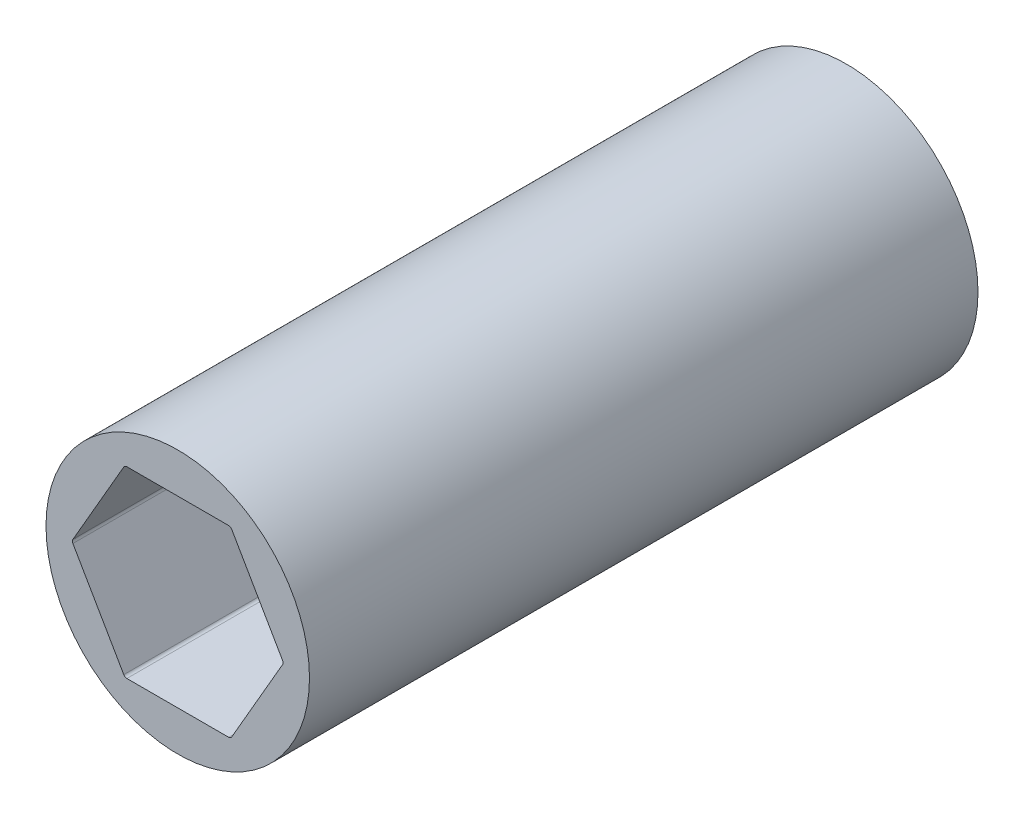
ISO-10303-21;
HEADER;
FILE_DESCRIPTION(('STEP AP214'),'2;1');
FILE_NAME('part.step','',(''),(''),'','','');
FILE_SCHEMA(('AUTOMOTIVE_DESIGN { 1 0 10303 214 1 1 1 1 }'));
ENDSEC;
DATA;
#1=APPLICATION_CONTEXT('core data for automotive mechanical design processes');
#2=APPLICATION_PROTOCOL_DEFINITION('international standard','automotive_design',2000,#1);
#3=PRODUCT_CONTEXT('',#1,'mechanical');
#4=PRODUCT('Part','Part','',(#3));
#5=PRODUCT_RELATED_PRODUCT_CATEGORY('part','',(#4));
#6=PRODUCT_DEFINITION_FORMATION('','',#4);
#7=PRODUCT_DEFINITION_CONTEXT('part definition',#1,'design');
#8=PRODUCT_DEFINITION('design','',#6,#7);
#9=PRODUCT_DEFINITION_SHAPE('','',#8);
#10=(LENGTH_UNIT() NAMED_UNIT(*) SI_UNIT(.MILLI.,.METRE.));
#11=(NAMED_UNIT(*) PLANE_ANGLE_UNIT() SI_UNIT($,.RADIAN.));
#12=(NAMED_UNIT(*) SI_UNIT($,.STERADIAN.) SOLID_ANGLE_UNIT());
#13=UNCERTAINTY_MEASURE_WITH_UNIT(LENGTH_MEASURE(1.E-05),#10,'distance_accuracy_value','');
#14=(GEOMETRIC_REPRESENTATION_CONTEXT(3) GLOBAL_UNCERTAINTY_ASSIGNED_CONTEXT((#13)) GLOBAL_UNIT_ASSIGNED_CONTEXT((#10,
#11,#12)) REPRESENTATION_CONTEXT('',''));
#15=CARTESIAN_POINT('',(0.,0.,0.));
#16=DIRECTION('',(0.,0.,1.));
#17=DIRECTION('',(1.,0.,0.));
#18=AXIS2_PLACEMENT_3D('',#15,#16,#17);
#19=CARTESIAN_POINT('',(7.25902493452117,0.,30.48));
#20=DIRECTION('',(0.,0.,1.));
#21=DIRECTION('',(1.,0.,0.));
#22=AXIS2_PLACEMENT_3D('',#19,#20,#21);
#23=CYLINDRICAL_SURFACE('',#22,0.254);
#24=CARTESIAN_POINT('',(7.25902493452117,0.,0.));
#25=DIRECTION('',(0.,0.,1.));
#26=DIRECTION('',(1.,0.,0.));
#27=AXIS2_PLACEMENT_3D('',#24,#25,#26);
#28=CIRCLE('',#27,0.254);
#29=CARTESIAN_POINT('',(7.51302493452117,0.,0.));
#30=VERTEX_POINT('',#29);
#31=CARTESIAN_POINT('',(7.47899538708242,0.127,0.));
#32=VERTEX_POINT('',#31);
#33=EDGE_CURVE('E67',#30,#32,#28,.T.);
#34=ORIENTED_EDGE('',*,*,#33,.F.);
#35=DIRECTION('',(0.,0.,1.));
#36=VECTOR('',#35,1.);
#37=CARTESIAN_POINT('',(7.51302493452117,0.,30.48));
#38=LINE('',#37,#36);
#39=CARTESIAN_POINT('',(7.51302493452117,0.,30.48));
#40=VERTEX_POINT('',#39);
#41=EDGE_CURVE('E11',#30,#40,#38,.T.);
#42=ORIENTED_EDGE('',*,*,#41,.T.);
#43=ORIENTED_EDGE('',*,*,#41,.F.);
#44=CARTESIAN_POINT('',(7.25902493452117,0.,0.));
#45=DIRECTION('',(0.,0.,1.));
#46=DIRECTION('',(1.,0.,0.));
#47=AXIS2_PLACEMENT_3D('',#44,#45,#46);
#48=CIRCLE('',#47,0.254);
#49=CARTESIAN_POINT('',(7.47899538708242,-0.127000000000001,0.));
#50=VERTEX_POINT('',#49);
#51=EDGE_CURVE('E150',#50,#30,#48,.T.);
#52=ORIENTED_EDGE('',*,*,#51,.F.);
#53=DIRECTION('',(0.,0.,-1.));
#54=VECTOR('',#53,1.);
#55=CARTESIAN_POINT('',(7.47899538708242,-0.127,0.));
#56=LINE('',#55,#54);
#57=CARTESIAN_POINT('',(7.47899538708242,-0.127000000000002,47.6885));
#58=VERTEX_POINT('',#57);
#59=EDGE_CURVE('E128',#58,#50,#56,.T.);
#60=ORIENTED_EDGE('',*,*,#59,.F.);
#61=CARTESIAN_POINT('',(7.25902493452117,0.,47.6885));
#62=DIRECTION('',(0.,0.,1.));
#63=DIRECTION('',(1.,0.,0.));
#64=AXIS2_PLACEMENT_3D('',#61,#62,#63);
#65=CIRCLE('',#64,0.254000000000002);
#66=CARTESIAN_POINT('',(7.47899538708242,0.127,47.6885));
#67=VERTEX_POINT('',#66);
#68=EDGE_CURVE('E659',#58,#67,#65,.T.);
#69=ORIENTED_EDGE('',*,*,#68,.T.);
#70=DIRECTION('',(0.,0.,1.));
#71=VECTOR('',#70,1.);
#72=CARTESIAN_POINT('',(7.47899538708242,0.127,30.48));
#73=LINE('',#72,#71);
#74=EDGE_CURVE('E160',#32,#67,#73,.T.);
#75=ORIENTED_EDGE('',*,*,#74,.F.);
#76=EDGE_LOOP('',(#34,#42,#43,#52,#60,#69,#75));
#77=FACE_BOUND('',#76,.T.);
#78=ADVANCED_FACE('F43',(#77),#23,.F.);
#79=CARTESIAN_POINT('',(0.,0.,30.48));
#80=DIRECTION('',(0.,0.,-1.));
#81=DIRECTION('',(-1.,0.,0.));
#82=AXIS2_PLACEMENT_3D('',#79,#80,#81);
#83=CYLINDRICAL_SURFACE('',#82,9.398);
#84=DIRECTION('',(0.,0.,-1.));
#85=VECTOR('',#84,1.);
#86=CARTESIAN_POINT('',(-9.398,0.,30.48));
#87=LINE('',#86,#85);
#88=CARTESIAN_POINT('',(-9.398,0.,30.48));
#89=VERTEX_POINT('',#88);
#90=CARTESIAN_POINT('',(-9.398,0.,0.));
#91=VERTEX_POINT('',#90);
#92=EDGE_CURVE('E104',#89,#91,#87,.T.);
#93=ORIENTED_EDGE('',*,*,#92,.F.);
#94=ORIENTED_EDGE('',*,*,#92,.T.);
#95=CARTESIAN_POINT('',(0.,0.,0.));
#96=DIRECTION('',(0.,0.,1.));
#97=DIRECTION('',(1.,0.,0.));
#98=AXIS2_PLACEMENT_3D('',#95,#96,#97);
#99=CIRCLE('',#98,9.398);
#100=CARTESIAN_POINT('',(9.398,0.,0.));
#101=VERTEX_POINT('',#100);
#102=EDGE_CURVE('E109',#91,#101,#99,.T.);
#103=ORIENTED_EDGE('',*,*,#102,.T.);
#104=DIRECTION('',(0.,0.,-1.));
#105=VECTOR('',#104,1.);
#106=CARTESIAN_POINT('',(9.398,0.,30.48));
#107=LINE('',#106,#105);
#108=CARTESIAN_POINT('',(9.398,0.,30.48));
#109=VERTEX_POINT('',#108);
#110=EDGE_CURVE('E54',#109,#101,#107,.T.);
#111=ORIENTED_EDGE('',*,*,#110,.F.);
#112=ORIENTED_EDGE('',*,*,#110,.T.);
#113=CARTESIAN_POINT('',(0.,0.,0.));
#114=DIRECTION('',(0.,0.,1.));
#115=DIRECTION('',(1.,0.,0.));
#116=AXIS2_PLACEMENT_3D('',#113,#114,#115);
#117=CIRCLE('',#116,9.398);
#118=EDGE_CURVE('E115',#101,#91,#117,.T.);
#119=ORIENTED_EDGE('',*,*,#118,.T.);
#120=EDGE_LOOP('',(#93,#94,#103,#111,#112,#119));
#121=FACE_BOUND('',#120,.T.);
#122=CARTESIAN_POINT('',(0.,0.,47.6885));
#123=DIRECTION('',(0.,0.,1.));
#124=DIRECTION('',(1.,0.,0.));
#125=AXIS2_PLACEMENT_3D('',#122,#123,#124);
#126=CIRCLE('',#125,9.398);
#127=CARTESIAN_POINT('',(9.398,0.,47.6885));
#128=VERTEX_POINT('',#127);
#129=EDGE_CURVE('E614',#128,#128,#126,.T.);
#130=ORIENTED_EDGE('',*,*,#129,.F.);
#131=EDGE_LOOP('',(#130));
#132=FACE_BOUND('',#131,.T.);
#133=ADVANCED_FACE('F106',(#121,#132),#83,.T.);
#134=CARTESIAN_POINT('',(0.,0.,0.));
#135=DIRECTION('',(0.,0.,1.));
#136=DIRECTION('',(1.,0.,0.));
#137=AXIS2_PLACEMENT_3D('',#134,#135,#136);
#138=PLANE('',#137);
#139=ORIENTED_EDGE('',*,*,#102,.F.);
#140=ORIENTED_EDGE('',*,*,#118,.F.);
#141=EDGE_LOOP('',(#139,#140));
#142=FACE_BOUND('',#141,.T.);
#143=DIRECTION('',(1.,0.,0.));
#144=VECTOR('',#143,1.);
#145=CARTESIAN_POINT('',(-3.77615943563474,-6.5405,0.));
#146=LINE('',#145,#144);
#147=CARTESIAN_POINT('',(-3.62951246726058,-6.5405,0.));
#148=VERTEX_POINT('',#147);
#149=CARTESIAN_POINT('',(3.62951246726058,-6.5405,0.));
#150=VERTEX_POINT('',#149);
#151=EDGE_CURVE('E118',#148,#150,#146,.T.);
#152=ORIENTED_EDGE('',*,*,#151,.T.);
#153=CARTESIAN_POINT('',(3.62951246726059,-6.2865,0.));
#154=DIRECTION('',(0.,0.,1.));
#155=DIRECTION('',(1.,0.,0.));
#156=AXIS2_PLACEMENT_3D('',#153,#154,#155);
#157=CIRCLE('',#156,0.254);
#158=CARTESIAN_POINT('',(3.84948291982184,-6.4135,0.));
#159=VERTEX_POINT('',#158);
#160=EDGE_CURVE('E149',#150,#159,#157,.T.);
#161=ORIENTED_EDGE('',*,*,#160,.T.);
#162=DIRECTION('',(0.5,0.866025403784439,0.));
#163=VECTOR('',#162,1.);
#164=CARTESIAN_POINT('',(3.77615943563475,-6.5405,0.));
#165=LINE('',#164,#163);
#166=EDGE_CURVE('E145',#159,#50,#165,.T.);
#167=ORIENTED_EDGE('',*,*,#166,.T.);
#168=ORIENTED_EDGE('',*,*,#51,.T.);
#169=ORIENTED_EDGE('',*,*,#33,.T.);
#170=DIRECTION('',(-0.5,0.866025403784438,0.));
#171=VECTOR('',#170,1.);
#172=CARTESIAN_POINT('',(7.5523188712695,0.,0.));
#173=LINE('',#172,#171);
#174=CARTESIAN_POINT('',(3.84948291982183,6.4135,0.));
#175=VERTEX_POINT('',#174);
#176=EDGE_CURVE('E140',#32,#175,#173,.T.);
#177=ORIENTED_EDGE('',*,*,#176,.T.);
#178=CARTESIAN_POINT('',(3.62951246726058,6.2865,0.));
#179=DIRECTION('',(0.,0.,1.));
#180=DIRECTION('',(1.,0.,0.));
#181=AXIS2_PLACEMENT_3D('',#178,#179,#180);
#182=CIRCLE('',#181,0.254);
#183=CARTESIAN_POINT('',(3.62951246726058,6.5405,0.));
#184=VERTEX_POINT('',#183);
#185=EDGE_CURVE('E144',#175,#184,#182,.T.);
#186=ORIENTED_EDGE('',*,*,#185,.T.);
#187=DIRECTION('',(-1.,0.,0.));
#188=VECTOR('',#187,1.);
#189=CARTESIAN_POINT('',(3.77615943563475,6.5405,0.));
#190=LINE('',#189,#188);
#191=CARTESIAN_POINT('',(-3.62951246726058,6.5405,0.));
#192=VERTEX_POINT('',#191);
#193=EDGE_CURVE('E138',#184,#192,#190,.T.);
#194=ORIENTED_EDGE('',*,*,#193,.T.);
#195=CARTESIAN_POINT('',(-3.62951246726058,6.2865,0.));
#196=DIRECTION('',(0.,0.,1.));
#197=DIRECTION('',(1.,0.,0.));
#198=AXIS2_PLACEMENT_3D('',#195,#196,#197);
#199=CIRCLE('',#198,0.254);
#200=CARTESIAN_POINT('',(-3.84948291982183,6.4135,0.));
#201=VERTEX_POINT('',#200);
#202=EDGE_CURVE('E134',#192,#201,#199,.T.);
#203=ORIENTED_EDGE('',*,*,#202,.T.);
#204=DIRECTION('',(-0.5,-0.866025403784439,0.));
#205=VECTOR('',#204,1.);
#206=CARTESIAN_POINT('',(-3.77615943563474,6.5405,0.));
#207=LINE('',#206,#205);
#208=CARTESIAN_POINT('',(-7.47899538708241,0.127000000000003,0.));
#209=VERTEX_POINT('',#208);
#210=EDGE_CURVE('E139',#201,#209,#207,.T.);
#211=ORIENTED_EDGE('',*,*,#210,.T.);
#212=CARTESIAN_POINT('',(-7.25902493452117,0.,0.));
#213=DIRECTION('',(0.,0.,1.));
#214=DIRECTION('',(1.,0.,0.));
#215=AXIS2_PLACEMENT_3D('',#212,#213,#214);
#216=CIRCLE('',#215,0.254);
#217=CARTESIAN_POINT('',(-7.47899538708241,-0.126999999999999,0.));
#218=VERTEX_POINT('',#217);
#219=EDGE_CURVE('E151',#209,#218,#216,.T.);
#220=ORIENTED_EDGE('',*,*,#219,.T.);
#221=DIRECTION('',(0.5,-0.866025403784439,0.));
#222=VECTOR('',#221,1.);
#223=CARTESIAN_POINT('',(-7.5523188712695,0.,0.));
#224=LINE('',#223,#222);
#225=CARTESIAN_POINT('',(-3.84948291982183,-6.4135,0.));
#226=VERTEX_POINT('',#225);
#227=EDGE_CURVE('E155',#218,#226,#224,.T.);
#228=ORIENTED_EDGE('',*,*,#227,.T.);
#229=CARTESIAN_POINT('',(-3.62951246726058,-6.2865,0.));
#230=DIRECTION('',(0.,0.,1.));
#231=DIRECTION('',(1.,0.,0.));
#232=AXIS2_PLACEMENT_3D('',#229,#230,#231);
#233=CIRCLE('',#232,0.254);
#234=EDGE_CURVE('E112',#226,#148,#233,.T.);
#235=ORIENTED_EDGE('',*,*,#234,.T.);
#236=EDGE_LOOP('',(#152,#161,#167,#168,#169,#177,#186,#194,#203,#211,#220,#228,#235));
#237=FACE_BOUND('',#236,.T.);
#238=ADVANCED_FACE('F120',(#142,#237),#138,.F.);
#239=CARTESIAN_POINT('',(3.77615943563475,-6.5405,30.48));
#240=DIRECTION('',(-0.866025403784439,0.5,0.));
#241=DIRECTION('',(0.,0.,1.));
#242=AXIS2_PLACEMENT_3D('',#239,#240,#241);
#243=PLANE('',#242);
#244=ORIENTED_EDGE('',*,*,#166,.F.);
#245=DIRECTION('',(0.,0.,1.));
#246=VECTOR('',#245,1.);
#247=CARTESIAN_POINT('',(3.84948291982184,-6.4135,30.48));
#248=LINE('',#247,#246);
#249=CARTESIAN_POINT('',(3.84948291982184,-6.4135,47.6885));
#250=VERTEX_POINT('',#249);
#251=EDGE_CURVE('E123',#159,#250,#248,.T.);
#252=ORIENTED_EDGE('',*,*,#251,.T.);
#253=DIRECTION('',(0.5,0.866025403784438,0.));
#254=VECTOR('',#253,1.);
#255=CARTESIAN_POINT('',(7.47899538708242,-0.127000000000001,47.6885));
#256=LINE('',#255,#254);
#257=EDGE_CURVE('E655',#250,#58,#256,.T.);
#258=ORIENTED_EDGE('',*,*,#257,.T.);
#259=ORIENTED_EDGE('',*,*,#59,.T.);
#260=EDGE_LOOP('',(#244,#252,#258,#259));
#261=FACE_BOUND('',#260,.T.);
#262=ADVANCED_FACE('F301',(#261),#243,.T.);
#263=CARTESIAN_POINT('',(7.5523188712695,0.,30.48));
#264=DIRECTION('',(-0.866025403784438,-0.5,0.));
#265=DIRECTION('',(-0.5,0.866025403784438,0.));
#266=AXIS2_PLACEMENT_3D('',#263,#264,#265);
#267=PLANE('',#266);
#268=ORIENTED_EDGE('',*,*,#74,.T.);
#269=DIRECTION('',(-0.500000000000001,0.866025403784438,0.));
#270=VECTOR('',#269,1.);
#271=CARTESIAN_POINT('',(3.84948291982183,6.4135,47.6885));
#272=LINE('',#271,#270);
#273=CARTESIAN_POINT('',(3.84948291982183,6.4135,47.6885));
#274=VERTEX_POINT('',#273);
#275=EDGE_CURVE('E663',#67,#274,#272,.T.);
#276=ORIENTED_EDGE('',*,*,#275,.T.);
#277=DIRECTION('',(0.,0.,-1.));
#278=VECTOR('',#277,1.);
#279=CARTESIAN_POINT('',(3.84948291982183,6.4135,0.));
#280=LINE('',#279,#278);
#281=EDGE_CURVE('E162',#274,#175,#280,.T.);
#282=ORIENTED_EDGE('',*,*,#281,.T.);
#283=ORIENTED_EDGE('',*,*,#176,.F.);
#284=EDGE_LOOP('',(#268,#276,#282,#283));
#285=FACE_BOUND('',#284,.T.);
#286=ADVANCED_FACE('F305',(#285),#267,.T.);
#287=CARTESIAN_POINT('',(3.77615943563475,6.5405,30.48));
#288=DIRECTION('',(0.,-1.,0.));
#289=DIRECTION('',(0.,0.,-1.));
#290=AXIS2_PLACEMENT_3D('',#287,#288,#289);
#291=PLANE('',#290);
#292=ORIENTED_EDGE('',*,*,#193,.F.);
#293=DIRECTION('',(0.,0.,1.));
#294=VECTOR('',#293,1.);
#295=CARTESIAN_POINT('',(3.62951246726058,6.5405,30.48));
#296=LINE('',#295,#294);
#297=CARTESIAN_POINT('',(3.62951246726058,6.5405,47.6885));
#298=VERTEX_POINT('',#297);
#299=EDGE_CURVE('E156',#184,#298,#296,.T.);
#300=ORIENTED_EDGE('',*,*,#299,.T.);
#301=DIRECTION('',(-1.,0.,0.));
#302=VECTOR('',#301,1.);
#303=CARTESIAN_POINT('',(-3.62951246726058,6.5405,47.6885));
#304=LINE('',#303,#302);
#305=CARTESIAN_POINT('',(-3.62951246726058,6.5405,47.6885));
#306=VERTEX_POINT('',#305);
#307=EDGE_CURVE('E671',#298,#306,#304,.T.);
#308=ORIENTED_EDGE('',*,*,#307,.T.);
#309=DIRECTION('',(0.,0.,-1.));
#310=VECTOR('',#309,1.);
#311=CARTESIAN_POINT('',(-3.62951246726058,6.5405,0.));
#312=LINE('',#311,#310);
#313=EDGE_CURVE('E161',#306,#192,#312,.T.);
#314=ORIENTED_EDGE('',*,*,#313,.T.);
#315=EDGE_LOOP('',(#292,#300,#308,#314));
#316=FACE_BOUND('',#315,.T.);
#317=ADVANCED_FACE('F295',(#316),#291,.T.);
#318=CARTESIAN_POINT('',(-3.77615943563474,6.5405,30.48));
#319=DIRECTION('',(0.866025403784439,-0.5,0.));
#320=DIRECTION('',(0.,0.,-1.));
#321=AXIS2_PLACEMENT_3D('',#318,#319,#320);
#322=PLANE('',#321);
#323=ORIENTED_EDGE('',*,*,#210,.F.);
#324=DIRECTION('',(0.,0.,1.));
#325=VECTOR('',#324,1.);
#326=CARTESIAN_POINT('',(-3.84948291982183,6.4135,30.48));
#327=LINE('',#326,#325);
#328=CARTESIAN_POINT('',(-3.84948291982183,6.4135,47.6885));
#329=VERTEX_POINT('',#328);
#330=EDGE_CURVE('E680',#201,#329,#327,.T.);
#331=ORIENTED_EDGE('',*,*,#330,.T.);
#332=DIRECTION('',(-0.5,-0.866025403784439,0.));
#333=VECTOR('',#332,1.);
#334=CARTESIAN_POINT('',(-7.47899538708241,0.127000000000003,47.6885));
#335=LINE('',#334,#333);
#336=CARTESIAN_POINT('',(-7.47899538708241,0.127000000000002,47.6885));
#337=VERTEX_POINT('',#336);
#338=EDGE_CURVE('E620',#329,#337,#335,.T.);
#339=ORIENTED_EDGE('',*,*,#338,.T.);
#340=DIRECTION('',(0.,0.,-1.));
#341=VECTOR('',#340,1.);
#342=CARTESIAN_POINT('',(-7.47899538708241,0.127000000000002,0.));
#343=LINE('',#342,#341);
#344=EDGE_CURVE('E266',#337,#209,#343,.T.);
#345=ORIENTED_EDGE('',*,*,#344,.T.);
#346=EDGE_LOOP('',(#323,#331,#339,#345));
#347=FACE_BOUND('',#346,.T.);
#348=ADVANCED_FACE('F290',(#347),#322,.T.);
#349=CARTESIAN_POINT('',(-7.5523188712695,0.,30.48));
#350=DIRECTION('',(0.866025403784439,0.5,0.));
#351=DIRECTION('',(0.,0.,-1.));
#352=AXIS2_PLACEMENT_3D('',#349,#350,#351);
#353=PLANE('',#352);
#354=DIRECTION('',(0.,0.,1.));
#355=VECTOR('',#354,1.);
#356=CARTESIAN_POINT('',(-7.47899538708241,-0.126999999999998,30.48));
#357=LINE('',#356,#355);
#358=CARTESIAN_POINT('',(-7.47899538708241,-0.126999999999999,47.6885));
#359=VERTEX_POINT('',#358);
#360=EDGE_CURVE('E267',#218,#359,#357,.T.);
#361=ORIENTED_EDGE('',*,*,#360,.T.);
#362=DIRECTION('',(0.5,-0.866025403784439,0.));
#363=VECTOR('',#362,1.);
#364=CARTESIAN_POINT('',(-3.84948291982183,-6.4135,47.6885));
#365=LINE('',#364,#363);
#366=CARTESIAN_POINT('',(-3.84948291982183,-6.4135,47.6885));
#367=VERTEX_POINT('',#366);
#368=EDGE_CURVE('E636',#359,#367,#365,.T.);
#369=ORIENTED_EDGE('',*,*,#368,.T.);
#370=DIRECTION('',(0.,0.,-1.));
#371=VECTOR('',#370,1.);
#372=CARTESIAN_POINT('',(-3.84948291982183,-6.4135,0.));
#373=LINE('',#372,#371);
#374=EDGE_CURVE('E261',#367,#226,#373,.T.);
#375=ORIENTED_EDGE('',*,*,#374,.T.);
#376=ORIENTED_EDGE('',*,*,#227,.F.);
#377=EDGE_LOOP('',(#361,#369,#375,#376));
#378=FACE_BOUND('',#377,.T.);
#379=ADVANCED_FACE('F294',(#378),#353,.T.);
#380=CARTESIAN_POINT('',(-3.77615943563474,-6.5405,30.48));
#381=DIRECTION('',(0.,1.,0.));
#382=DIRECTION('',(1.,0.,0.));
#383=AXIS2_PLACEMENT_3D('',#380,#381,#382);
#384=PLANE('',#383);
#385=ORIENTED_EDGE('',*,*,#151,.F.);
#386=DIRECTION('',(0.,0.,1.));
#387=VECTOR('',#386,1.);
#388=CARTESIAN_POINT('',(-3.62951246726058,-6.5405,30.48));
#389=LINE('',#388,#387);
#390=CARTESIAN_POINT('',(-3.62951246726058,-6.5405,47.6885));
#391=VERTEX_POINT('',#390);
#392=EDGE_CURVE('E132',#148,#391,#389,.T.);
#393=ORIENTED_EDGE('',*,*,#392,.T.);
#394=DIRECTION('',(1.,0.,0.));
#395=VECTOR('',#394,1.);
#396=CARTESIAN_POINT('',(3.62951246726058,-6.5405,47.6885));
#397=LINE('',#396,#395);
#398=CARTESIAN_POINT('',(3.62951246726058,-6.5405,47.6885));
#399=VERTEX_POINT('',#398);
#400=EDGE_CURVE('E647',#391,#399,#397,.T.);
#401=ORIENTED_EDGE('',*,*,#400,.T.);
#402=DIRECTION('',(0.,0.,-1.));
#403=VECTOR('',#402,1.);
#404=CARTESIAN_POINT('',(3.62951246726059,-6.5405,0.));
#405=LINE('',#404,#403);
#406=EDGE_CURVE('E274',#399,#150,#405,.T.);
#407=ORIENTED_EDGE('',*,*,#406,.T.);
#408=EDGE_LOOP('',(#385,#393,#401,#407));
#409=FACE_BOUND('',#408,.T.);
#410=ADVANCED_FACE('F356',(#409),#384,.T.);
#411=CARTESIAN_POINT('',(3.62951246726058,6.2865,30.48));
#412=DIRECTION('',(0.,0.,1.));
#413=DIRECTION('',(1.,0.,0.));
#414=AXIS2_PLACEMENT_3D('',#411,#412,#413);
#415=CYLINDRICAL_SURFACE('',#414,0.254);
#416=ORIENTED_EDGE('',*,*,#281,.F.);
#417=CARTESIAN_POINT('',(3.62951246726058,6.2865,47.6885));
#418=DIRECTION('',(0.,0.,1.));
#419=DIRECTION('',(-1.,0.,0.));
#420=AXIS2_PLACEMENT_3D('',#417,#418,#419);
#421=CIRCLE('',#420,0.254);
#422=EDGE_CURVE('E667',#274,#298,#421,.T.);
#423=ORIENTED_EDGE('',*,*,#422,.T.);
#424=ORIENTED_EDGE('',*,*,#299,.F.);
#425=ORIENTED_EDGE('',*,*,#185,.F.);
#426=EDGE_LOOP('',(#416,#423,#424,#425));
#427=FACE_BOUND('',#426,.T.);
#428=ADVANCED_FACE('F316',(#427),#415,.F.);
#429=CARTESIAN_POINT('',(-3.62951246726058,6.2865,30.48));
#430=DIRECTION('',(0.,0.,1.));
#431=DIRECTION('',(1.,0.,0.));
#432=AXIS2_PLACEMENT_3D('',#429,#430,#431);
#433=CYLINDRICAL_SURFACE('',#432,0.254);
#434=ORIENTED_EDGE('',*,*,#313,.F.);
#435=CARTESIAN_POINT('',(-3.62951246726058,6.2865,47.6885));
#436=DIRECTION('',(0.,0.,1.));
#437=DIRECTION('',(1.,0.,0.));
#438=AXIS2_PLACEMENT_3D('',#435,#436,#437);
#439=CIRCLE('',#438,0.254000000000001);
#440=EDGE_CURVE('E624',#306,#329,#439,.T.);
#441=ORIENTED_EDGE('',*,*,#440,.T.);
#442=ORIENTED_EDGE('',*,*,#330,.F.);
#443=ORIENTED_EDGE('',*,*,#202,.F.);
#444=EDGE_LOOP('',(#434,#441,#442,#443));
#445=FACE_BOUND('',#444,.T.);
#446=ADVANCED_FACE('F311',(#445),#433,.F.);
#447=CARTESIAN_POINT('',(-3.62951246726058,-6.2865,30.48));
#448=DIRECTION('',(0.,0.,1.));
#449=DIRECTION('',(1.,0.,0.));
#450=AXIS2_PLACEMENT_3D('',#447,#448,#449);
#451=CYLINDRICAL_SURFACE('',#450,0.254);
#452=ORIENTED_EDGE('',*,*,#374,.F.);
#453=CARTESIAN_POINT('',(-3.62951246726058,-6.2865,47.6885));
#454=DIRECTION('',(0.,0.,1.));
#455=DIRECTION('',(-1.,0.,0.));
#456=AXIS2_PLACEMENT_3D('',#453,#454,#455);
#457=CIRCLE('',#456,0.254000000000001);
#458=EDGE_CURVE('E643',#367,#391,#457,.T.);
#459=ORIENTED_EDGE('',*,*,#458,.T.);
#460=ORIENTED_EDGE('',*,*,#392,.F.);
#461=ORIENTED_EDGE('',*,*,#234,.F.);
#462=EDGE_LOOP('',(#452,#459,#460,#461));
#463=FACE_BOUND('',#462,.T.);
#464=ADVANCED_FACE('F315',(#463),#451,.F.);
#465=CARTESIAN_POINT('',(3.62951246726059,-6.2865,30.48));
#466=DIRECTION('',(0.,0.,1.));
#467=DIRECTION('',(1.,0.,0.));
#468=AXIS2_PLACEMENT_3D('',#465,#466,#467);
#469=CYLINDRICAL_SURFACE('',#468,0.254);
#470=ORIENTED_EDGE('',*,*,#406,.F.);
#471=CARTESIAN_POINT('',(3.62951246726059,-6.2865,47.6885));
#472=DIRECTION('',(0.,0.,1.));
#473=DIRECTION('',(1.,0.,0.));
#474=AXIS2_PLACEMENT_3D('',#471,#472,#473);
#475=CIRCLE('',#474,0.253999999999999);
#476=EDGE_CURVE('E651',#399,#250,#475,.T.);
#477=ORIENTED_EDGE('',*,*,#476,.T.);
#478=ORIENTED_EDGE('',*,*,#251,.F.);
#479=ORIENTED_EDGE('',*,*,#160,.F.);
#480=EDGE_LOOP('',(#470,#477,#478,#479));
#481=FACE_BOUND('',#480,.T.);
#482=ADVANCED_FACE('F344',(#481),#469,.F.);
#483=CARTESIAN_POINT('',(-7.25902493452117,0.,30.48));
#484=DIRECTION('',(0.,0.,1.));
#485=DIRECTION('',(1.,0.,0.));
#486=AXIS2_PLACEMENT_3D('',#483,#484,#485);
#487=CYLINDRICAL_SURFACE('',#486,0.254);
#488=ORIENTED_EDGE('',*,*,#344,.F.);
#489=CARTESIAN_POINT('',(-7.25902493452117,0.,47.6885));
#490=DIRECTION('',(0.,0.,1.));
#491=DIRECTION('',(-1.,0.,0.));
#492=AXIS2_PLACEMENT_3D('',#489,#490,#491);
#493=CIRCLE('',#492,0.253999999999994);
#494=EDGE_CURVE('E628',#337,#359,#493,.T.);
#495=ORIENTED_EDGE('',*,*,#494,.T.);
#496=ORIENTED_EDGE('',*,*,#360,.F.);
#497=ORIENTED_EDGE('',*,*,#219,.F.);
#498=EDGE_LOOP('',(#488,#495,#496,#497));
#499=FACE_BOUND('',#498,.T.);
#500=ADVANCED_FACE('F45',(#499),#487,.F.);
#501=CARTESIAN_POINT('',(0.,0.,47.6885));
#502=DIRECTION('',(0.,0.,1.));
#503=DIRECTION('',(1.,0.,0.));
#504=AXIS2_PLACEMENT_3D('',#501,#502,#503);
#505=PLANE('',#504);
#506=ORIENTED_EDGE('',*,*,#129,.T.);
#507=EDGE_LOOP('',(#506));
#508=FACE_BOUND('',#507,.T.);
#509=ORIENTED_EDGE('',*,*,#338,.F.);
#510=ORIENTED_EDGE('',*,*,#440,.F.);
#511=ORIENTED_EDGE('',*,*,#307,.F.);
#512=ORIENTED_EDGE('',*,*,#422,.F.);
#513=ORIENTED_EDGE('',*,*,#275,.F.);
#514=ORIENTED_EDGE('',*,*,#68,.F.);
#515=ORIENTED_EDGE('',*,*,#257,.F.);
#516=ORIENTED_EDGE('',*,*,#476,.F.);
#517=ORIENTED_EDGE('',*,*,#400,.F.);
#518=ORIENTED_EDGE('',*,*,#458,.F.);
#519=ORIENTED_EDGE('',*,*,#368,.F.);
#520=ORIENTED_EDGE('',*,*,#494,.F.);
#521=EDGE_LOOP('',(#509,#510,#511,#512,#513,#514,#515,#516,#517,#518,#519,#520));
#522=FACE_BOUND('',#521,.T.);
#523=ADVANCED_FACE('F403',(#508,#522),#505,.T.);
#524=CLOSED_SHELL('',(#78,#133,#238,#262,#286,#317,#348,#379,#410,#428,#446,#464,#482,#500,#523));
#525=MANIFOLD_SOLID_BREP('B2',#524);
#526=ADVANCED_BREP_SHAPE_REPRESENTATION('',(#18,#525),#14);
#527=SHAPE_DEFINITION_REPRESENTATION(#9,#526);
ENDSEC;
END-ISO-10303-21;
